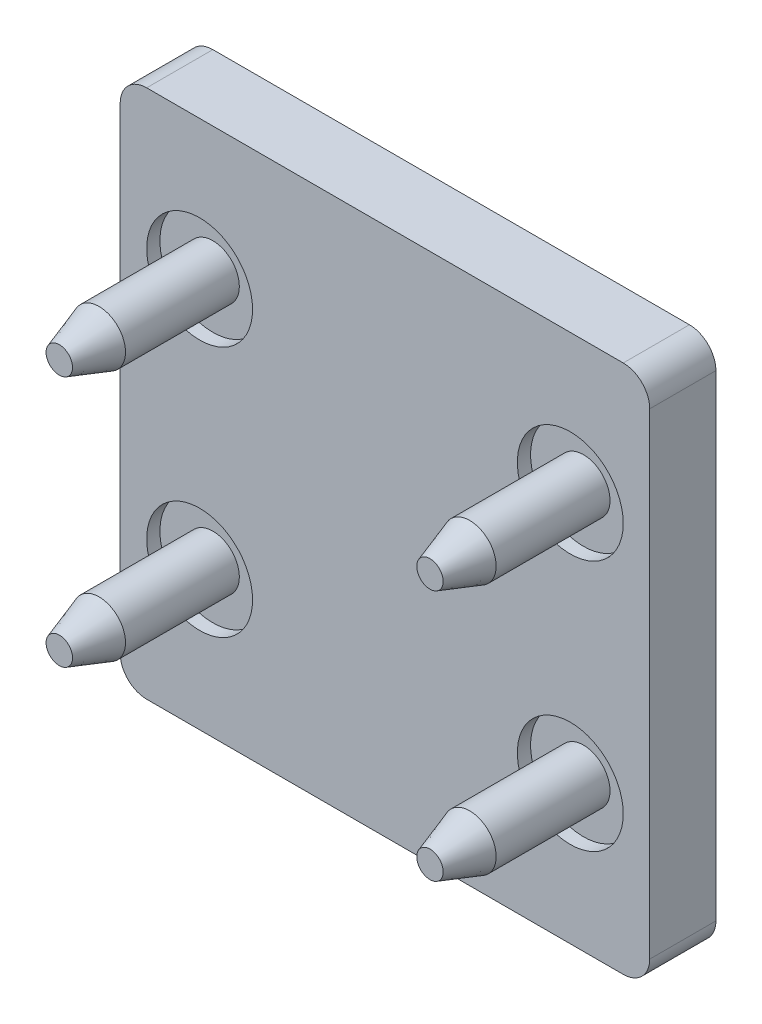
ISO-10303-21;
HEADER;
FILE_DESCRIPTION(('STEP AP214'),'2;1');
FILE_NAME('part.step','',(''),(''),'','','');
FILE_SCHEMA(('AUTOMOTIVE_DESIGN { 1 0 10303 214 1 1 1 1 }'));
ENDSEC;
DATA;
#1=APPLICATION_CONTEXT('core data for automotive mechanical design processes');
#2=APPLICATION_PROTOCOL_DEFINITION('international standard','automotive_design',2000,#1);
#3=PRODUCT_CONTEXT('',#1,'mechanical');
#4=PRODUCT('Part','Part','',(#3));
#5=PRODUCT_RELATED_PRODUCT_CATEGORY('part','',(#4));
#6=PRODUCT_DEFINITION_FORMATION('','',#4);
#7=PRODUCT_DEFINITION_CONTEXT('part definition',#1,'design');
#8=PRODUCT_DEFINITION('design','',#6,#7);
#9=PRODUCT_DEFINITION_SHAPE('','',#8);
#10=(LENGTH_UNIT() NAMED_UNIT(*) SI_UNIT(.MILLI.,.METRE.));
#11=(NAMED_UNIT(*) PLANE_ANGLE_UNIT() SI_UNIT($,.RADIAN.));
#12=(NAMED_UNIT(*) SI_UNIT($,.STERADIAN.) SOLID_ANGLE_UNIT());
#13=UNCERTAINTY_MEASURE_WITH_UNIT(LENGTH_MEASURE(1.E-05),#10,'distance_accuracy_value','');
#14=(GEOMETRIC_REPRESENTATION_CONTEXT(3) GLOBAL_UNCERTAINTY_ASSIGNED_CONTEXT((#13)) GLOBAL_UNIT_ASSIGNED_CONTEXT((#10,
#11,#12)) REPRESENTATION_CONTEXT('',''));
#15=CARTESIAN_POINT('',(0.,0.,0.));
#16=DIRECTION('',(0.,0.,1.));
#17=DIRECTION('',(1.,0.,0.));
#18=AXIS2_PLACEMENT_3D('',#15,#16,#17);
#19=CARTESIAN_POINT('',(-7.,-2.75,-0.5));
#20=DIRECTION('',(0.,0.,1.));
#21=DIRECTION('',(1.,0.,0.));
#22=AXIS2_PLACEMENT_3D('',#19,#20,#21);
#23=PLANE('',#22);
#24=CARTESIAN_POINT('',(-7.,-4.75,-0.5));
#25=DIRECTION('',(0.,0.,1.));
#26=DIRECTION('',(1.,0.,0.));
#27=AXIS2_PLACEMENT_3D('',#24,#25,#26);
#28=CIRCLE('',#27,2.);
#29=CARTESIAN_POINT('',(-5.,-4.75,-0.5));
#30=VERTEX_POINT('',#29);
#31=EDGE_CURVE('E514',#30,#30,#28,.T.);
#32=ORIENTED_EDGE('',*,*,#31,.T.);
#33=EDGE_LOOP('',(#32));
#34=FACE_BOUND('',#33,.T.);
#35=CARTESIAN_POINT('',(-7.,-4.75,-0.5));
#36=DIRECTION('',(0.,0.,1.));
#37=DIRECTION('',(1.,0.,0.));
#38=AXIS2_PLACEMENT_3D('',#35,#36,#37);
#39=CIRCLE('',#38,1.);
#40=CARTESIAN_POINT('',(-6.,-4.75,-0.5));
#41=VERTEX_POINT('',#40);
#42=EDGE_CURVE('E480',#41,#41,#39,.T.);
#43=ORIENTED_EDGE('',*,*,#42,.F.);
#44=EDGE_LOOP('',(#43));
#45=FACE_BOUND('',#44,.T.);
#46=ADVANCED_FACE('F32',(#34,#45),#23,.T.);
#47=CARTESIAN_POINT('',(7.,-2.75,-0.5));
#48=DIRECTION('',(0.,0.,1.));
#49=DIRECTION('',(1.,0.,0.));
#50=AXIS2_PLACEMENT_3D('',#47,#48,#49);
#51=PLANE('',#50);
#52=CARTESIAN_POINT('',(7.,-4.75,-0.5));
#53=DIRECTION('',(0.,0.,1.));
#54=DIRECTION('',(1.,0.,0.));
#55=AXIS2_PLACEMENT_3D('',#52,#53,#54);
#56=CIRCLE('',#55,2.);
#57=CARTESIAN_POINT('',(9.,-4.75,-0.5));
#58=VERTEX_POINT('',#57);
#59=EDGE_CURVE('E519',#58,#58,#56,.T.);
#60=ORIENTED_EDGE('',*,*,#59,.T.);
#61=EDGE_LOOP('',(#60));
#62=FACE_BOUND('',#61,.T.);
#63=CARTESIAN_POINT('',(7.,-4.75,-0.5));
#64=DIRECTION('',(0.,0.,1.));
#65=DIRECTION('',(1.,0.,0.));
#66=AXIS2_PLACEMENT_3D('',#63,#64,#65);
#67=CIRCLE('',#66,1.);
#68=CARTESIAN_POINT('',(8.,-4.75,-0.5));
#69=VERTEX_POINT('',#68);
#70=EDGE_CURVE('E487',#69,#69,#67,.T.);
#71=ORIENTED_EDGE('',*,*,#70,.F.);
#72=EDGE_LOOP('',(#71));
#73=FACE_BOUND('',#72,.T.);
#74=ADVANCED_FACE('F174',(#62,#73),#51,.T.);
#75=CARTESIAN_POINT('',(7.,6.75,-0.5));
#76=DIRECTION('',(0.,0.,1.));
#77=DIRECTION('',(1.,0.,0.));
#78=AXIS2_PLACEMENT_3D('',#75,#76,#77);
#79=PLANE('',#78);
#80=CARTESIAN_POINT('',(7.,4.75,-0.5));
#81=DIRECTION('',(0.,0.,1.));
#82=DIRECTION('',(1.,0.,0.));
#83=AXIS2_PLACEMENT_3D('',#80,#81,#82);
#84=CIRCLE('',#83,2.);
#85=CARTESIAN_POINT('',(9.,4.75,-0.5));
#86=VERTEX_POINT('',#85);
#87=EDGE_CURVE('E523',#86,#86,#84,.T.);
#88=ORIENTED_EDGE('',*,*,#87,.T.);
#89=EDGE_LOOP('',(#88));
#90=FACE_BOUND('',#89,.T.);
#91=CARTESIAN_POINT('',(7.,4.75,-0.5));
#92=DIRECTION('',(0.,0.,1.));
#93=DIRECTION('',(1.,0.,0.));
#94=AXIS2_PLACEMENT_3D('',#91,#92,#93);
#95=CIRCLE('',#94,1.);
#96=CARTESIAN_POINT('',(8.,4.75,-0.5));
#97=VERTEX_POINT('',#96);
#98=EDGE_CURVE('E496',#97,#97,#95,.T.);
#99=ORIENTED_EDGE('',*,*,#98,.F.);
#100=EDGE_LOOP('',(#99));
#101=FACE_BOUND('',#100,.T.);
#102=ADVANCED_FACE('F180',(#90,#101),#79,.T.);
#103=CARTESIAN_POINT('',(-7.,6.75,-0.5));
#104=DIRECTION('',(0.,0.,1.));
#105=DIRECTION('',(1.,0.,0.));
#106=AXIS2_PLACEMENT_3D('',#103,#104,#105);
#107=PLANE('',#106);
#108=CARTESIAN_POINT('',(-7.,4.75,-0.5));
#109=DIRECTION('',(0.,0.,1.));
#110=DIRECTION('',(1.,0.,0.));
#111=AXIS2_PLACEMENT_3D('',#108,#109,#110);
#112=CIRCLE('',#111,2.);
#113=CARTESIAN_POINT('',(-5.,4.75,-0.5));
#114=VERTEX_POINT('',#113);
#115=EDGE_CURVE('E223',#114,#114,#112,.T.);
#116=ORIENTED_EDGE('',*,*,#115,.T.);
#117=EDGE_LOOP('',(#116));
#118=FACE_BOUND('',#117,.T.);
#119=CARTESIAN_POINT('',(-7.,4.75,-0.5));
#120=DIRECTION('',(0.,0.,1.));
#121=DIRECTION('',(1.,0.,0.));
#122=AXIS2_PLACEMENT_3D('',#119,#120,#121);
#123=CIRCLE('',#122,1.);
#124=CARTESIAN_POINT('',(-6.,4.75,-0.5));
#125=VERTEX_POINT('',#124);
#126=EDGE_CURVE('E505',#125,#125,#123,.T.);
#127=ORIENTED_EDGE('',*,*,#126,.F.);
#128=EDGE_LOOP('',(#127));
#129=FACE_BOUND('',#128,.T.);
#130=ADVANCED_FACE('F200',(#118,#129),#107,.T.);
#131=CARTESIAN_POINT('',(-8.99999999999983,8.99999999999983,0.));
#132=DIRECTION('',(0.,0.,1.));
#133=DIRECTION('',(1.,0.,0.));
#134=AXIS2_PLACEMENT_3D('',#131,#132,#133);
#135=PLANE('',#134);
#136=CARTESIAN_POINT('',(7.,-4.75,0.));
#137=DIRECTION('',(0.,0.,1.));
#138=DIRECTION('',(1.,0.,0.));
#139=AXIS2_PLACEMENT_3D('',#136,#137,#138);
#140=CIRCLE('',#139,2.);
#141=CARTESIAN_POINT('',(9.,-4.75,0.));
#142=VERTEX_POINT('',#141);
#143=EDGE_CURVE('E220',#142,#142,#140,.T.);
#144=ORIENTED_EDGE('',*,*,#143,.F.);
#145=EDGE_LOOP('',(#144));
#146=FACE_BOUND('',#145,.T.);
#147=CARTESIAN_POINT('',(-7.,4.75,0.));
#148=DIRECTION('',(0.,0.,1.));
#149=DIRECTION('',(1.,0.,0.));
#150=AXIS2_PLACEMENT_3D('',#147,#148,#149);
#151=CIRCLE('',#150,2.);
#152=CARTESIAN_POINT('',(-5.,4.75,0.));
#153=VERTEX_POINT('',#152);
#154=EDGE_CURVE('E134',#153,#153,#151,.T.);
#155=ORIENTED_EDGE('',*,*,#154,.F.);
#156=EDGE_LOOP('',(#155));
#157=FACE_BOUND('',#156,.T.);
#158=CARTESIAN_POINT('',(-8.99999999999983,8.99999999999983,0.));
#159=DIRECTION('',(0.,0.,1.));
#160=DIRECTION('',(1.,0.,0.));
#161=AXIS2_PLACEMENT_3D('',#158,#159,#160);
#162=CIRCLE('',#161,1.00000000000017);
#163=CARTESIAN_POINT('',(-9.,10.,0.));
#164=VERTEX_POINT('',#163);
#165=CARTESIAN_POINT('',(-10.,9.,0.));
#166=VERTEX_POINT('',#165);
#167=EDGE_CURVE('E130',#164,#166,#162,.T.);
#168=ORIENTED_EDGE('',*,*,#167,.T.);
#169=DIRECTION('',(0.,-1.,0.));
#170=VECTOR('',#169,1.);
#171=CARTESIAN_POINT('',(-10.,9.,0.));
#172=LINE('',#171,#170);
#173=CARTESIAN_POINT('',(-10.,-9.,0.));
#174=VERTEX_POINT('',#173);
#175=EDGE_CURVE('E133',#166,#174,#172,.T.);
#176=ORIENTED_EDGE('',*,*,#175,.T.);
#177=CARTESIAN_POINT('',(-8.99999999999983,-8.99999999999983,0.));
#178=DIRECTION('',(0.,0.,1.));
#179=DIRECTION('',(1.,0.,0.));
#180=AXIS2_PLACEMENT_3D('',#177,#178,#179);
#181=CIRCLE('',#180,1.00000000000017);
#182=CARTESIAN_POINT('',(-9.,-10.,0.));
#183=VERTEX_POINT('',#182);
#184=EDGE_CURVE('E137',#174,#183,#181,.T.);
#185=ORIENTED_EDGE('',*,*,#184,.T.);
#186=DIRECTION('',(1.,0.,0.));
#187=VECTOR('',#186,1.);
#188=CARTESIAN_POINT('',(-9.,-10.,0.));
#189=LINE('',#188,#187);
#190=CARTESIAN_POINT('',(9.,-10.,0.));
#191=VERTEX_POINT('',#190);
#192=EDGE_CURVE('E140',#183,#191,#189,.T.);
#193=ORIENTED_EDGE('',*,*,#192,.T.);
#194=CARTESIAN_POINT('',(8.99999999999983,-8.99999999999983,0.));
#195=DIRECTION('',(0.,0.,1.));
#196=DIRECTION('',(1.,0.,0.));
#197=AXIS2_PLACEMENT_3D('',#194,#195,#196);
#198=CIRCLE('',#197,1.00000000000017);
#199=CARTESIAN_POINT('',(10.,-9.,0.));
#200=VERTEX_POINT('',#199);
#201=EDGE_CURVE('E143',#191,#200,#198,.T.);
#202=ORIENTED_EDGE('',*,*,#201,.T.);
#203=DIRECTION('',(0.,1.,0.));
#204=VECTOR('',#203,1.);
#205=CARTESIAN_POINT('',(10.,-9.,0.));
#206=LINE('',#205,#204);
#207=CARTESIAN_POINT('',(10.,9.,0.));
#208=VERTEX_POINT('',#207);
#209=EDGE_CURVE('E146',#200,#208,#206,.T.);
#210=ORIENTED_EDGE('',*,*,#209,.T.);
#211=CARTESIAN_POINT('',(8.99999999999983,8.99999999999983,0.));
#212=DIRECTION('',(0.,0.,1.));
#213=DIRECTION('',(1.,0.,0.));
#214=AXIS2_PLACEMENT_3D('',#211,#212,#213);
#215=CIRCLE('',#214,1.00000000000017);
#216=CARTESIAN_POINT('',(9.,10.,0.));
#217=VERTEX_POINT('',#216);
#218=EDGE_CURVE('E107',#208,#217,#215,.T.);
#219=ORIENTED_EDGE('',*,*,#218,.T.);
#220=DIRECTION('',(-1.,0.,0.));
#221=VECTOR('',#220,1.);
#222=CARTESIAN_POINT('',(9.,10.,0.));
#223=LINE('',#222,#221);
#224=EDGE_CURVE('E149',#217,#164,#223,.T.);
#225=ORIENTED_EDGE('',*,*,#224,.T.);
#226=EDGE_LOOP('',(#168,#176,#185,#193,#202,#210,#219,#225));
#227=FACE_BOUND('',#226,.T.);
#228=CARTESIAN_POINT('',(7.,4.75,0.));
#229=DIRECTION('',(0.,0.,1.));
#230=DIRECTION('',(1.,0.,0.));
#231=AXIS2_PLACEMENT_3D('',#228,#229,#230);
#232=CIRCLE('',#231,2.);
#233=CARTESIAN_POINT('',(9.,4.75,0.));
#234=VERTEX_POINT('',#233);
#235=EDGE_CURVE('E226',#234,#234,#232,.T.);
#236=ORIENTED_EDGE('',*,*,#235,.F.);
#237=EDGE_LOOP('',(#236));
#238=FACE_BOUND('',#237,.T.);
#239=CARTESIAN_POINT('',(-7.,-4.75,0.));
#240=DIRECTION('',(0.,0.,1.));
#241=DIRECTION('',(1.,0.,0.));
#242=AXIS2_PLACEMENT_3D('',#239,#240,#241);
#243=CIRCLE('',#242,2.);
#244=CARTESIAN_POINT('',(-5.,-4.75,0.));
#245=VERTEX_POINT('',#244);
#246=EDGE_CURVE('E516',#245,#245,#243,.T.);
#247=ORIENTED_EDGE('',*,*,#246,.F.);
#248=EDGE_LOOP('',(#247));
#249=FACE_BOUND('',#248,.T.);
#250=ADVANCED_FACE('F162',(#146,#157,#227,#238,#249),#135,.T.);
#251=CARTESIAN_POINT('',(-8.99999999999983,8.99999999999983,-2.5));
#252=DIRECTION('',(0.,0.,1.));
#253=DIRECTION('',(1.,0.,0.));
#254=AXIS2_PLACEMENT_3D('',#251,#252,#253);
#255=CYLINDRICAL_SURFACE('',#254,1.00000000000017);
#256=ORIENTED_EDGE('',*,*,#167,.F.);
#257=DIRECTION('',(0.,0.,1.));
#258=VECTOR('',#257,1.);
#259=CARTESIAN_POINT('',(-9.,10.,-2.5));
#260=LINE('',#259,#258);
#261=CARTESIAN_POINT('',(-9.,10.,-2.5));
#262=VERTEX_POINT('',#261);
#263=EDGE_CURVE('E11',#262,#164,#260,.T.);
#264=ORIENTED_EDGE('',*,*,#263,.F.);
#265=CARTESIAN_POINT('',(-8.99999999999983,8.99999999999983,-2.5));
#266=DIRECTION('',(0.,0.,1.));
#267=DIRECTION('',(1.,0.,0.));
#268=AXIS2_PLACEMENT_3D('',#265,#266,#267);
#269=CIRCLE('',#268,1.00000000000017);
#270=CARTESIAN_POINT('',(-10.,9.,-2.5));
#271=VERTEX_POINT('',#270);
#272=EDGE_CURVE('E151',#262,#271,#269,.T.);
#273=ORIENTED_EDGE('',*,*,#272,.T.);
#274=DIRECTION('',(0.,0.,1.));
#275=VECTOR('',#274,1.);
#276=CARTESIAN_POINT('',(-10.,9.,-2.5));
#277=LINE('',#276,#275);
#278=EDGE_CURVE('E36',#271,#166,#277,.T.);
#279=ORIENTED_EDGE('',*,*,#278,.T.);
#280=EDGE_LOOP('',(#256,#264,#273,#279));
#281=FACE_BOUND('',#280,.T.);
#282=ADVANCED_FACE('F34',(#281),#255,.T.);
#283=CARTESIAN_POINT('',(9.,10.,-2.5));
#284=DIRECTION('',(0.,1.,0.));
#285=DIRECTION('',(0.,0.,1.));
#286=AXIS2_PLACEMENT_3D('',#283,#284,#285);
#287=PLANE('',#286);
#288=ORIENTED_EDGE('',*,*,#224,.F.);
#289=DIRECTION('',(0.,0.,1.));
#290=VECTOR('',#289,1.);
#291=CARTESIAN_POINT('',(9.,10.,-2.5));
#292=LINE('',#291,#290);
#293=CARTESIAN_POINT('',(9.,10.,-2.5));
#294=VERTEX_POINT('',#293);
#295=EDGE_CURVE('E42',#294,#217,#292,.T.);
#296=ORIENTED_EDGE('',*,*,#295,.F.);
#297=DIRECTION('',(-1.,0.,0.));
#298=VECTOR('',#297,1.);
#299=CARTESIAN_POINT('',(9.,10.,-2.5));
#300=LINE('',#299,#298);
#301=EDGE_CURVE('E120',#294,#262,#300,.T.);
#302=ORIENTED_EDGE('',*,*,#301,.T.);
#303=ORIENTED_EDGE('',*,*,#263,.T.);
#304=EDGE_LOOP('',(#288,#296,#302,#303));
#305=FACE_BOUND('',#304,.T.);
#306=ADVANCED_FACE('F164',(#305),#287,.T.);
#307=CARTESIAN_POINT('',(8.99999999999983,8.99999999999983,-2.5));
#308=DIRECTION('',(0.,0.,1.));
#309=DIRECTION('',(1.,0.,0.));
#310=AXIS2_PLACEMENT_3D('',#307,#308,#309);
#311=CYLINDRICAL_SURFACE('',#310,1.00000000000017);
#312=ORIENTED_EDGE('',*,*,#218,.F.);
#313=DIRECTION('',(0.,0.,1.));
#314=VECTOR('',#313,1.);
#315=CARTESIAN_POINT('',(10.,9.,-2.5));
#316=LINE('',#315,#314);
#317=CARTESIAN_POINT('',(10.,9.,-2.5));
#318=VERTEX_POINT('',#317);
#319=EDGE_CURVE('E102',#318,#208,#316,.T.);
#320=ORIENTED_EDGE('',*,*,#319,.F.);
#321=CARTESIAN_POINT('',(8.99999999999983,8.99999999999983,-2.5));
#322=DIRECTION('',(0.,0.,1.));
#323=DIRECTION('',(1.,0.,0.));
#324=AXIS2_PLACEMENT_3D('',#321,#322,#323);
#325=CIRCLE('',#324,1.00000000000017);
#326=EDGE_CURVE('E105',#318,#294,#325,.T.);
#327=ORIENTED_EDGE('',*,*,#326,.T.);
#328=ORIENTED_EDGE('',*,*,#295,.T.);
#329=EDGE_LOOP('',(#312,#320,#327,#328));
#330=FACE_BOUND('',#329,.T.);
#331=ADVANCED_FACE('F104',(#330),#311,.T.);
#332=CARTESIAN_POINT('',(10.,-9.,-2.5));
#333=DIRECTION('',(1.,0.,0.));
#334=DIRECTION('',(0.,0.,-1.));
#335=AXIS2_PLACEMENT_3D('',#332,#333,#334);
#336=PLANE('',#335);
#337=ORIENTED_EDGE('',*,*,#209,.F.);
#338=DIRECTION('',(0.,0.,1.));
#339=VECTOR('',#338,1.);
#340=CARTESIAN_POINT('',(10.,-9.,-2.5));
#341=LINE('',#340,#339);
#342=CARTESIAN_POINT('',(10.,-9.,-2.5));
#343=VERTEX_POINT('',#342);
#344=EDGE_CURVE('E112',#343,#200,#341,.T.);
#345=ORIENTED_EDGE('',*,*,#344,.F.);
#346=DIRECTION('',(0.,1.,0.));
#347=VECTOR('',#346,1.);
#348=CARTESIAN_POINT('',(10.,-9.,-2.5));
#349=LINE('',#348,#347);
#350=EDGE_CURVE('E118',#343,#318,#349,.T.);
#351=ORIENTED_EDGE('',*,*,#350,.T.);
#352=ORIENTED_EDGE('',*,*,#319,.T.);
#353=EDGE_LOOP('',(#337,#345,#351,#352));
#354=FACE_BOUND('',#353,.T.);
#355=ADVANCED_FACE('F122',(#354),#336,.T.);
#356=CARTESIAN_POINT('',(8.99999999999983,-8.99999999999983,-2.5));
#357=DIRECTION('',(0.,0.,1.));
#358=DIRECTION('',(1.,0.,0.));
#359=AXIS2_PLACEMENT_3D('',#356,#357,#358);
#360=CYLINDRICAL_SURFACE('',#359,1.00000000000017);
#361=ORIENTED_EDGE('',*,*,#201,.F.);
#362=DIRECTION('',(0.,0.,1.));
#363=VECTOR('',#362,1.);
#364=CARTESIAN_POINT('',(9.,-10.,-2.5));
#365=LINE('',#364,#363);
#366=CARTESIAN_POINT('',(9.,-10.,-2.5));
#367=VERTEX_POINT('',#366);
#368=EDGE_CURVE('E155',#367,#191,#365,.T.);
#369=ORIENTED_EDGE('',*,*,#368,.F.);
#370=CARTESIAN_POINT('',(8.99999999999983,-8.99999999999983,-2.5));
#371=DIRECTION('',(0.,0.,1.));
#372=DIRECTION('',(1.,0.,0.));
#373=AXIS2_PLACEMENT_3D('',#370,#371,#372);
#374=CIRCLE('',#373,1.00000000000017);
#375=EDGE_CURVE('E123',#367,#343,#374,.T.);
#376=ORIENTED_EDGE('',*,*,#375,.T.);
#377=ORIENTED_EDGE('',*,*,#344,.T.);
#378=EDGE_LOOP('',(#361,#369,#376,#377));
#379=FACE_BOUND('',#378,.T.);
#380=ADVANCED_FACE('F245',(#379),#360,.T.);
#381=CARTESIAN_POINT('',(-9.,-10.,-2.5));
#382=DIRECTION('',(0.,-1.,0.));
#383=DIRECTION('',(0.,0.,-1.));
#384=AXIS2_PLACEMENT_3D('',#381,#382,#383);
#385=PLANE('',#384);
#386=ORIENTED_EDGE('',*,*,#192,.F.);
#387=DIRECTION('',(0.,0.,1.));
#388=VECTOR('',#387,1.);
#389=CARTESIAN_POINT('',(-9.,-10.,-2.5));
#390=LINE('',#389,#388);
#391=CARTESIAN_POINT('',(-9.,-10.,-2.5));
#392=VERTEX_POINT('',#391);
#393=EDGE_CURVE('E157',#392,#183,#390,.T.);
#394=ORIENTED_EDGE('',*,*,#393,.F.);
#395=DIRECTION('',(1.,0.,0.));
#396=VECTOR('',#395,1.);
#397=CARTESIAN_POINT('',(-9.,-10.,-2.5));
#398=LINE('',#397,#396);
#399=EDGE_CURVE('E125',#392,#367,#398,.T.);
#400=ORIENTED_EDGE('',*,*,#399,.T.);
#401=ORIENTED_EDGE('',*,*,#368,.T.);
#402=EDGE_LOOP('',(#386,#394,#400,#401));
#403=FACE_BOUND('',#402,.T.);
#404=ADVANCED_FACE('F239',(#403),#385,.T.);
#405=CARTESIAN_POINT('',(-8.99999999999983,-8.99999999999983,-2.5));
#406=DIRECTION('',(0.,0.,1.));
#407=DIRECTION('',(1.,0.,0.));
#408=AXIS2_PLACEMENT_3D('',#405,#406,#407);
#409=CYLINDRICAL_SURFACE('',#408,1.00000000000017);
#410=ORIENTED_EDGE('',*,*,#184,.F.);
#411=DIRECTION('',(0.,0.,1.));
#412=VECTOR('',#411,1.);
#413=CARTESIAN_POINT('',(-10.,-9.,-2.5));
#414=LINE('',#413,#412);
#415=CARTESIAN_POINT('',(-10.,-9.,-2.5));
#416=VERTEX_POINT('',#415);
#417=EDGE_CURVE('E158',#416,#174,#414,.T.);
#418=ORIENTED_EDGE('',*,*,#417,.F.);
#419=CARTESIAN_POINT('',(-8.99999999999983,-8.99999999999983,-2.5));
#420=DIRECTION('',(0.,0.,1.));
#421=DIRECTION('',(1.,0.,0.));
#422=AXIS2_PLACEMENT_3D('',#419,#420,#421);
#423=CIRCLE('',#422,1.00000000000017);
#424=EDGE_CURVE('E233',#416,#392,#423,.T.);
#425=ORIENTED_EDGE('',*,*,#424,.T.);
#426=ORIENTED_EDGE('',*,*,#393,.T.);
#427=EDGE_LOOP('',(#410,#418,#425,#426));
#428=FACE_BOUND('',#427,.T.);
#429=ADVANCED_FACE('F243',(#428),#409,.T.);
#430=CARTESIAN_POINT('',(-10.,9.,-2.5));
#431=DIRECTION('',(-1.,0.,0.));
#432=DIRECTION('',(0.,0.,1.));
#433=AXIS2_PLACEMENT_3D('',#430,#431,#432);
#434=PLANE('',#433);
#435=ORIENTED_EDGE('',*,*,#175,.F.);
#436=ORIENTED_EDGE('',*,*,#278,.F.);
#437=DIRECTION('',(0.,-1.,0.));
#438=VECTOR('',#437,1.);
#439=CARTESIAN_POINT('',(-10.,9.,-2.5));
#440=LINE('',#439,#438);
#441=EDGE_CURVE('E231',#271,#416,#440,.T.);
#442=ORIENTED_EDGE('',*,*,#441,.T.);
#443=ORIENTED_EDGE('',*,*,#417,.T.);
#444=EDGE_LOOP('',(#435,#436,#442,#443));
#445=FACE_BOUND('',#444,.T.);
#446=ADVANCED_FACE('F160',(#445),#434,.T.);
#447=CARTESIAN_POINT('',(-8.99999999999983,8.99999999999983,-2.5));
#448=DIRECTION('',(0.,0.,1.));
#449=DIRECTION('',(1.,0.,0.));
#450=AXIS2_PLACEMENT_3D('',#447,#448,#449);
#451=PLANE('',#450);
#452=ORIENTED_EDGE('',*,*,#272,.F.);
#453=ORIENTED_EDGE('',*,*,#301,.F.);
#454=ORIENTED_EDGE('',*,*,#326,.F.);
#455=ORIENTED_EDGE('',*,*,#350,.F.);
#456=ORIENTED_EDGE('',*,*,#375,.F.);
#457=ORIENTED_EDGE('',*,*,#399,.F.);
#458=ORIENTED_EDGE('',*,*,#424,.F.);
#459=ORIENTED_EDGE('',*,*,#441,.F.);
#460=EDGE_LOOP('',(#452,#453,#454,#455,#456,#457,#458,#459));
#461=FACE_BOUND('',#460,.T.);
#462=ADVANCED_FACE('F116',(#461),#451,.F.);
#463=CARTESIAN_POINT('',(-7.,4.75,-0.5));
#464=DIRECTION('',(0.,0.,1.));
#465=DIRECTION('',(1.,0.,0.));
#466=AXIS2_PLACEMENT_3D('',#463,#464,#465);
#467=CYLINDRICAL_SURFACE('',#466,2.);
#468=ORIENTED_EDGE('',*,*,#154,.T.);
#469=EDGE_LOOP('',(#468));
#470=FACE_BOUND('',#469,.T.);
#471=ORIENTED_EDGE('',*,*,#115,.F.);
#472=EDGE_LOOP('',(#471));
#473=FACE_BOUND('',#472,.T.);
#474=ADVANCED_FACE('F204',(#470,#473),#467,.F.);
#475=CARTESIAN_POINT('',(7.,4.75,-0.5));
#476=DIRECTION('',(0.,0.,1.));
#477=DIRECTION('',(1.,0.,0.));
#478=AXIS2_PLACEMENT_3D('',#475,#476,#477);
#479=CYLINDRICAL_SURFACE('',#478,2.);
#480=ORIENTED_EDGE('',*,*,#235,.T.);
#481=EDGE_LOOP('',(#480));
#482=FACE_BOUND('',#481,.T.);
#483=ORIENTED_EDGE('',*,*,#87,.F.);
#484=EDGE_LOOP('',(#483));
#485=FACE_BOUND('',#484,.T.);
#486=ADVANCED_FACE('F196',(#482,#485),#479,.F.);
#487=CARTESIAN_POINT('',(7.,-4.75,-0.5));
#488=DIRECTION('',(0.,0.,1.));
#489=DIRECTION('',(1.,0.,0.));
#490=AXIS2_PLACEMENT_3D('',#487,#488,#489);
#491=CYLINDRICAL_SURFACE('',#490,2.);
#492=ORIENTED_EDGE('',*,*,#143,.T.);
#493=EDGE_LOOP('',(#492));
#494=FACE_BOUND('',#493,.T.);
#495=ORIENTED_EDGE('',*,*,#59,.F.);
#496=EDGE_LOOP('',(#495));
#497=FACE_BOUND('',#496,.T.);
#498=ADVANCED_FACE('F191',(#494,#497),#491,.F.);
#499=CARTESIAN_POINT('',(-7.,-4.75,-0.5));
#500=DIRECTION('',(0.,0.,1.));
#501=DIRECTION('',(1.,0.,0.));
#502=AXIS2_PLACEMENT_3D('',#499,#500,#501);
#503=CYLINDRICAL_SURFACE('',#502,2.);
#504=ORIENTED_EDGE('',*,*,#246,.T.);
#505=EDGE_LOOP('',(#504));
#506=FACE_BOUND('',#505,.T.);
#507=ORIENTED_EDGE('',*,*,#31,.F.);
#508=EDGE_LOOP('',(#507));
#509=FACE_BOUND('',#508,.T.);
#510=ADVANCED_FACE('F189',(#506,#509),#503,.F.);
#511=CARTESIAN_POINT('',(-7.,4.75,5.3));
#512=DIRECTION('',(0.,0.,-1.));
#513=DIRECTION('',(-1.,0.,0.));
#514=AXIS2_PLACEMENT_3D('',#511,#512,#513);
#515=PLANE('',#514);
#516=CARTESIAN_POINT('',(-7.,4.75,5.3));
#517=DIRECTION('',(0.,0.,1.));
#518=DIRECTION('',(1.,0.,0.));
#519=AXIS2_PLACEMENT_3D('',#516,#517,#518);
#520=CIRCLE('',#519,0.5);
#521=CARTESIAN_POINT('',(-6.5,4.75,5.3));
#522=VERTEX_POINT('',#521);
#523=EDGE_CURVE('E511',#522,#522,#520,.T.);
#524=ORIENTED_EDGE('',*,*,#523,.T.);
#525=EDGE_LOOP('',(#524));
#526=FACE_BOUND('',#525,.T.);
#527=ADVANCED_FACE('F187',(#526),#515,.F.);
#528=CARTESIAN_POINT('',(-7.,4.75,3.8));
#529=DIRECTION('',(0.,0.,-1.));
#530=DIRECTION('',(-1.,0.,0.));
#531=AXIS2_PLACEMENT_3D('',#528,#529,#530);
#532=CONICAL_SURFACE('',#531,1.,0.321750554396642);
#533=ORIENTED_EDGE('',*,*,#523,.F.);
#534=EDGE_LOOP('',(#533));
#535=FACE_BOUND('',#534,.T.);
#536=CARTESIAN_POINT('',(-7.,4.75,3.8));
#537=DIRECTION('',(0.,0.,1.));
#538=DIRECTION('',(1.,0.,0.));
#539=AXIS2_PLACEMENT_3D('',#536,#537,#538);
#540=CIRCLE('',#539,1.);
#541=CARTESIAN_POINT('',(-6.,4.75,3.8));
#542=VERTEX_POINT('',#541);
#543=EDGE_CURVE('E508',#542,#542,#540,.T.);
#544=ORIENTED_EDGE('',*,*,#543,.T.);
#545=EDGE_LOOP('',(#544));
#546=FACE_BOUND('',#545,.T.);
#547=ADVANCED_FACE('F288',(#535,#546),#532,.T.);
#548=CARTESIAN_POINT('',(-7.,4.75,-0.5));
#549=DIRECTION('',(0.,0.,1.));
#550=DIRECTION('',(1.,0.,0.));
#551=AXIS2_PLACEMENT_3D('',#548,#549,#550);
#552=CYLINDRICAL_SURFACE('',#551,1.);
#553=ORIENTED_EDGE('',*,*,#543,.F.);
#554=EDGE_LOOP('',(#553));
#555=FACE_BOUND('',#554,.T.);
#556=ORIENTED_EDGE('',*,*,#126,.T.);
#557=EDGE_LOOP('',(#556));
#558=FACE_BOUND('',#557,.T.);
#559=ADVANCED_FACE('F295',(#555,#558),#552,.T.);
#560=CARTESIAN_POINT('',(7.,4.75,5.3));
#561=DIRECTION('',(0.,0.,-1.));
#562=DIRECTION('',(-1.,0.,0.));
#563=AXIS2_PLACEMENT_3D('',#560,#561,#562);
#564=PLANE('',#563);
#565=CARTESIAN_POINT('',(7.,4.75,5.3));
#566=DIRECTION('',(0.,0.,1.));
#567=DIRECTION('',(1.,0.,0.));
#568=AXIS2_PLACEMENT_3D('',#565,#566,#567);
#569=CIRCLE('',#568,0.5);
#570=CARTESIAN_POINT('',(7.5,4.75,5.3));
#571=VERTEX_POINT('',#570);
#572=EDGE_CURVE('E502',#571,#571,#569,.T.);
#573=ORIENTED_EDGE('',*,*,#572,.T.);
#574=EDGE_LOOP('',(#573));
#575=FACE_BOUND('',#574,.T.);
#576=ADVANCED_FACE('F302',(#575),#564,.F.);
#577=CARTESIAN_POINT('',(7.,4.75,3.8));
#578=DIRECTION('',(0.,0.,-1.));
#579=DIRECTION('',(-1.,0.,0.));
#580=AXIS2_PLACEMENT_3D('',#577,#578,#579);
#581=CONICAL_SURFACE('',#580,1.,0.321750554396642);
#582=ORIENTED_EDGE('',*,*,#572,.F.);
#583=EDGE_LOOP('',(#582));
#584=FACE_BOUND('',#583,.T.);
#585=CARTESIAN_POINT('',(7.,4.75,3.8));
#586=DIRECTION('',(0.,0.,1.));
#587=DIRECTION('',(1.,0.,0.));
#588=AXIS2_PLACEMENT_3D('',#585,#586,#587);
#589=CIRCLE('',#588,1.);
#590=CARTESIAN_POINT('',(8.,4.75,3.8));
#591=VERTEX_POINT('',#590);
#592=EDGE_CURVE('E499',#591,#591,#589,.T.);
#593=ORIENTED_EDGE('',*,*,#592,.T.);
#594=EDGE_LOOP('',(#593));
#595=FACE_BOUND('',#594,.T.);
#596=ADVANCED_FACE('F311',(#584,#595),#581,.T.);
#597=CARTESIAN_POINT('',(7.,4.75,-0.5));
#598=DIRECTION('',(0.,0.,1.));
#599=DIRECTION('',(1.,0.,0.));
#600=AXIS2_PLACEMENT_3D('',#597,#598,#599);
#601=CYLINDRICAL_SURFACE('',#600,1.);
#602=ORIENTED_EDGE('',*,*,#592,.F.);
#603=EDGE_LOOP('',(#602));
#604=FACE_BOUND('',#603,.T.);
#605=ORIENTED_EDGE('',*,*,#98,.T.);
#606=EDGE_LOOP('',(#605));
#607=FACE_BOUND('',#606,.T.);
#608=ADVANCED_FACE('F319',(#604,#607),#601,.T.);
#609=CARTESIAN_POINT('',(7.,-4.75,5.3));
#610=DIRECTION('',(0.,0.,-1.));
#611=DIRECTION('',(-1.,0.,0.));
#612=AXIS2_PLACEMENT_3D('',#609,#610,#611);
#613=PLANE('',#612);
#614=CARTESIAN_POINT('',(7.,-4.75,5.3));
#615=DIRECTION('',(0.,0.,1.));
#616=DIRECTION('',(1.,0.,0.));
#617=AXIS2_PLACEMENT_3D('',#614,#615,#616);
#618=CIRCLE('',#617,0.5);
#619=CARTESIAN_POINT('',(7.5,-4.75,5.3));
#620=VERTEX_POINT('',#619);
#621=EDGE_CURVE('E493',#620,#620,#618,.T.);
#622=ORIENTED_EDGE('',*,*,#621,.T.);
#623=EDGE_LOOP('',(#622));
#624=FACE_BOUND('',#623,.T.);
#625=ADVANCED_FACE('F327',(#624),#613,.F.);
#626=CARTESIAN_POINT('',(7.,-4.75,3.8));
#627=DIRECTION('',(0.,0.,-1.));
#628=DIRECTION('',(-1.,0.,0.));
#629=AXIS2_PLACEMENT_3D('',#626,#627,#628);
#630=CONICAL_SURFACE('',#629,1.,0.321750554396642);
#631=ORIENTED_EDGE('',*,*,#621,.F.);
#632=EDGE_LOOP('',(#631));
#633=FACE_BOUND('',#632,.T.);
#634=CARTESIAN_POINT('',(7.,-4.75,3.8));
#635=DIRECTION('',(0.,0.,1.));
#636=DIRECTION('',(1.,0.,0.));
#637=AXIS2_PLACEMENT_3D('',#634,#635,#636);
#638=CIRCLE('',#637,1.);
#639=CARTESIAN_POINT('',(8.,-4.75,3.8));
#640=VERTEX_POINT('',#639);
#641=EDGE_CURVE('E490',#640,#640,#638,.T.);
#642=ORIENTED_EDGE('',*,*,#641,.T.);
#643=EDGE_LOOP('',(#642));
#644=FACE_BOUND('',#643,.T.);
#645=ADVANCED_FACE('F336',(#633,#644),#630,.T.);
#646=CARTESIAN_POINT('',(7.,-4.75,-0.5));
#647=DIRECTION('',(0.,0.,1.));
#648=DIRECTION('',(1.,0.,0.));
#649=AXIS2_PLACEMENT_3D('',#646,#647,#648);
#650=CYLINDRICAL_SURFACE('',#649,1.);
#651=ORIENTED_EDGE('',*,*,#641,.F.);
#652=EDGE_LOOP('',(#651));
#653=FACE_BOUND('',#652,.T.);
#654=ORIENTED_EDGE('',*,*,#70,.T.);
#655=EDGE_LOOP('',(#654));
#656=FACE_BOUND('',#655,.T.);
#657=ADVANCED_FACE('F344',(#653,#656),#650,.T.);
#658=CARTESIAN_POINT('',(-7.,-4.75,5.3));
#659=DIRECTION('',(0.,0.,-1.));
#660=DIRECTION('',(-1.,0.,0.));
#661=AXIS2_PLACEMENT_3D('',#658,#659,#660);
#662=PLANE('',#661);
#663=CARTESIAN_POINT('',(-7.,-4.75,5.3));
#664=DIRECTION('',(0.,0.,1.));
#665=DIRECTION('',(1.,0.,0.));
#666=AXIS2_PLACEMENT_3D('',#663,#664,#665);
#667=CIRCLE('',#666,0.5);
#668=CARTESIAN_POINT('',(-6.5,-4.75,5.3));
#669=VERTEX_POINT('',#668);
#670=EDGE_CURVE('E482',#669,#669,#667,.T.);
#671=ORIENTED_EDGE('',*,*,#670,.T.);
#672=EDGE_LOOP('',(#671));
#673=FACE_BOUND('',#672,.T.);
#674=ADVANCED_FACE('F352',(#673),#662,.F.);
#675=CARTESIAN_POINT('',(-7.,-4.75,3.8));
#676=DIRECTION('',(0.,0.,-1.));
#677=DIRECTION('',(-1.,0.,0.));
#678=AXIS2_PLACEMENT_3D('',#675,#676,#677);
#679=CONICAL_SURFACE('',#678,1.,0.321750554396642);
#680=ORIENTED_EDGE('',*,*,#670,.F.);
#681=EDGE_LOOP('',(#680));
#682=FACE_BOUND('',#681,.T.);
#683=CARTESIAN_POINT('',(-7.,-4.75,3.8));
#684=DIRECTION('',(0.,0.,1.));
#685=DIRECTION('',(1.,0.,0.));
#686=AXIS2_PLACEMENT_3D('',#683,#684,#685);
#687=CIRCLE('',#686,1.);
#688=CARTESIAN_POINT('',(-6.,-4.75,3.8));
#689=VERTEX_POINT('',#688);
#690=EDGE_CURVE('E477',#689,#689,#687,.T.);
#691=ORIENTED_EDGE('',*,*,#690,.T.);
#692=EDGE_LOOP('',(#691));
#693=FACE_BOUND('',#692,.T.);
#694=ADVANCED_FACE('F360',(#682,#693),#679,.T.);
#695=CARTESIAN_POINT('',(-7.,-4.75,-0.5));
#696=DIRECTION('',(0.,0.,1.));
#697=DIRECTION('',(1.,0.,0.));
#698=AXIS2_PLACEMENT_3D('',#695,#696,#697);
#699=CYLINDRICAL_SURFACE('',#698,1.);
#700=ORIENTED_EDGE('',*,*,#690,.F.);
#701=EDGE_LOOP('',(#700));
#702=FACE_BOUND('',#701,.T.);
#703=ORIENTED_EDGE('',*,*,#42,.T.);
#704=EDGE_LOOP('',(#703));
#705=FACE_BOUND('',#704,.T.);
#706=ADVANCED_FACE('F368',(#702,#705),#699,.T.);
#707=CLOSED_SHELL('',(#46,#74,#102,#130,#250,#282,#306,#331,#355,#380,#404,#429,#446,#462,#474,
#486,#498,#510,#527,#547,#559,#576,#596,#608,#625,#645,#657,#674,#694,#706));
#708=MANIFOLD_SOLID_BREP('B2',#707);
#709=ADVANCED_BREP_SHAPE_REPRESENTATION('',(#18,#708),#14);
#710=SHAPE_DEFINITION_REPRESENTATION(#9,#709);
ENDSEC;
END-ISO-10303-21;
